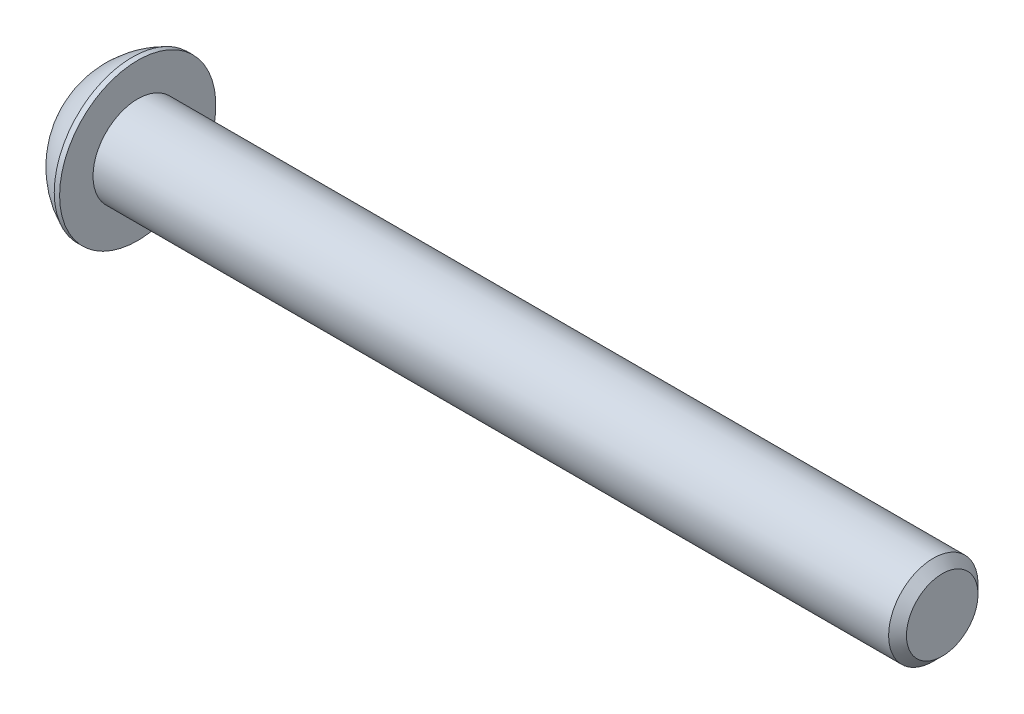
ISO-10303-21;
HEADER;
FILE_DESCRIPTION(('STEP AP214'),'2;1');
FILE_NAME('part.step','',(''),(''),'','','');
FILE_SCHEMA(('AUTOMOTIVE_DESIGN { 1 0 10303 214 1 1 1 1 }'));
ENDSEC;
DATA;
#1=APPLICATION_CONTEXT('core data for automotive mechanical design processes');
#2=APPLICATION_PROTOCOL_DEFINITION('international standard','automotive_design',2000,#1);
#3=PRODUCT_CONTEXT('',#1,'mechanical');
#4=PRODUCT('Part','Part','',(#3));
#5=PRODUCT_RELATED_PRODUCT_CATEGORY('part','',(#4));
#6=PRODUCT_DEFINITION_FORMATION('','',#4);
#7=PRODUCT_DEFINITION_CONTEXT('part definition',#1,'design');
#8=PRODUCT_DEFINITION('design','',#6,#7);
#9=PRODUCT_DEFINITION_SHAPE('','',#8);
#10=(LENGTH_UNIT() NAMED_UNIT(*) SI_UNIT(.MILLI.,.METRE.));
#11=(NAMED_UNIT(*) PLANE_ANGLE_UNIT() SI_UNIT($,.RADIAN.));
#12=(NAMED_UNIT(*) SI_UNIT($,.STERADIAN.) SOLID_ANGLE_UNIT());
#13=UNCERTAINTY_MEASURE_WITH_UNIT(LENGTH_MEASURE(1.E-05),#10,'distance_accuracy_value','');
#14=(GEOMETRIC_REPRESENTATION_CONTEXT(3) GLOBAL_UNCERTAINTY_ASSIGNED_CONTEXT((#13)) GLOBAL_UNIT_ASSIGNED_CONTEXT((#10,
#11,#12)) REPRESENTATION_CONTEXT('',''));
#15=CARTESIAN_POINT('',(0.,0.,0.));
#16=DIRECTION('',(0.,0.,1.));
#17=DIRECTION('',(1.,0.,0.));
#18=AXIS2_PLACEMENT_3D('',#15,#16,#17);
#19=CARTESIAN_POINT('',(1.32080000000034,0.,0.));
#20=DIRECTION('',(-1.,0.,0.));
#21=DIRECTION('',(0.,0.,1.));
#22=AXIS2_PLACEMENT_3D('',#19,#20,#21);
#23=CONICAL_SURFACE('',#22,1.1937999999998,1.04719755119608);
#24=CARTESIAN_POINT('',(2.01004075135902,0.,-4.44089209850063E-13));
#25=VERTEX_POINT('',#24);
#26=VERTEX_LOOP('',#25);
#27=FACE_BOUND('',#26,.T.);
#28=CARTESIAN_POINT('',(1.32080000000009,0.,0.));
#29=DIRECTION('',(-1.,0.,0.));
#30=DIRECTION('',(0.,0.,1.));
#31=AXIS2_PLACEMENT_3D('',#28,#29,#30);
#32=CIRCLE('',#31,1.19380000000024);
#33=CARTESIAN_POINT('',(1.32080000000009,0.,1.19380000000024));
#34=VERTEX_POINT('',#33);
#35=EDGE_CURVE('E19',#34,#34,#32,.T.);
#36=ORIENTED_EDGE('',*,*,#35,.T.);
#37=EDGE_LOOP('',(#36));
#38=FACE_BOUND('',#37,.T.);
#39=ADVANCED_FACE('F16',(#27,#38),#23,.F.);
#40=CARTESIAN_POINT('',(1.3208,-2.29135888084633,0.));
#41=DIRECTION('',(1.,0.,0.));
#42=DIRECTION('',(0.,0.,-1.));
#43=AXIS2_PLACEMENT_3D('',#40,#41,#42);
#44=PLANE('',#43);
#45=DIRECTION('',(0.,1.,0.));
#46=VECTOR('',#45,1.);
#47=CARTESIAN_POINT('',(1.3208,-1.14567944042316,1.984375));
#48=LINE('',#47,#46);
#49=CARTESIAN_POINT('',(1.3208,1.14567944042316,1.984375));
#50=VERTEX_POINT('',#49);
#51=CARTESIAN_POINT('',(1.3208,-1.14567944042316,1.984375));
#52=VERTEX_POINT('',#51);
#53=EDGE_CURVE('E68',#50,#52,#48,.F.);
#54=ORIENTED_EDGE('',*,*,#53,.F.);
#55=DIRECTION('',(0.,0.5,-0.866025403784439));
#56=VECTOR('',#55,1.);
#57=CARTESIAN_POINT('',(1.3208,1.14567944042316,1.984375));
#58=LINE('',#57,#56);
#59=CARTESIAN_POINT('',(1.3208,2.29135888084633,0.));
#60=VERTEX_POINT('',#59);
#61=EDGE_CURVE('E291',#60,#50,#58,.F.);
#62=ORIENTED_EDGE('',*,*,#61,.F.);
#63=DIRECTION('',(0.,-0.5,-0.866025403784439));
#64=VECTOR('',#63,1.);
#65=CARTESIAN_POINT('',(1.3208,2.29135888084633,0.));
#66=LINE('',#65,#64);
#67=CARTESIAN_POINT('',(1.3208,1.14567944042316,-1.984375));
#68=VERTEX_POINT('',#67);
#69=EDGE_CURVE('E295',#68,#60,#66,.F.);
#70=ORIENTED_EDGE('',*,*,#69,.F.);
#71=DIRECTION('',(0.,1.,0.));
#72=VECTOR('',#71,1.);
#73=CARTESIAN_POINT('',(1.3208,1.14567944042316,-1.984375));
#74=LINE('',#73,#72);
#75=CARTESIAN_POINT('',(1.3208,-1.14567944042316,-1.984375));
#76=VERTEX_POINT('',#75);
#77=EDGE_CURVE('E300',#76,#68,#74,.T.);
#78=ORIENTED_EDGE('',*,*,#77,.F.);
#79=DIRECTION('',(0.,-0.500000000000001,0.866025403784438));
#80=VECTOR('',#79,1.);
#81=CARTESIAN_POINT('',(1.3208,-1.14567944042316,-1.984375));
#82=LINE('',#81,#80);
#83=CARTESIAN_POINT('',(1.3208,-2.29135888084633,0.));
#84=VERTEX_POINT('',#83);
#85=EDGE_CURVE('E305',#84,#76,#82,.F.);
#86=ORIENTED_EDGE('',*,*,#85,.F.);
#87=DIRECTION('',(0.,0.500000000000001,0.866025403784438));
#88=VECTOR('',#87,1.);
#89=CARTESIAN_POINT('',(1.3208,-2.29135888084633,0.));
#90=LINE('',#89,#88);
#91=EDGE_CURVE('E81',#52,#84,#90,.F.);
#92=ORIENTED_EDGE('',*,*,#91,.F.);
#93=EDGE_LOOP('',(#54,#62,#70,#78,#86,#92));
#94=FACE_BOUND('',#93,.T.);
#95=ORIENTED_EDGE('',*,*,#35,.F.);
#96=EDGE_LOOP('',(#95));
#97=FACE_BOUND('',#96,.T.);
#98=ADVANCED_FACE('F74',(#94,#97),#44,.F.);
#99=CARTESIAN_POINT('',(1.3208,-1.14567944042316,1.984375));
#100=DIRECTION('',(0.,0.,-1.));
#101=DIRECTION('',(0.,1.,0.));
#102=AXIS2_PLACEMENT_3D('',#99,#100,#101);
#103=PLANE('',#102);
#104=ORIENTED_EDGE('',*,*,#53,.T.);
#105=DIRECTION('',(1.,0.,0.));
#106=VECTOR('',#105,1.);
#107=CARTESIAN_POINT('',(1.3208,-1.14567944042316,1.984375));
#108=LINE('',#107,#106);
#109=CARTESIAN_POINT('',(0.,-1.14567944042316,1.984375));
#110=VERTEX_POINT('',#109);
#111=EDGE_CURVE('E78',#110,#52,#108,.T.);
#112=ORIENTED_EDGE('',*,*,#111,.F.);
#113=DIRECTION('',(0.,1.,0.));
#114=VECTOR('',#113,1.);
#115=CARTESIAN_POINT('',(0.,0.,1.984375));
#116=LINE('',#115,#114);
#117=CARTESIAN_POINT('',(0.,1.14567944042316,1.984375));
#118=VERTEX_POINT('',#117);
#119=EDGE_CURVE('E285',#118,#110,#116,.F.);
#120=ORIENTED_EDGE('',*,*,#119,.F.);
#121=DIRECTION('',(1.,0.,0.));
#122=VECTOR('',#121,1.);
#123=CARTESIAN_POINT('',(1.3208,1.14567944042316,1.984375));
#124=LINE('',#123,#122);
#125=EDGE_CURVE('E288',#50,#118,#124,.F.);
#126=ORIENTED_EDGE('',*,*,#125,.F.);
#127=EDGE_LOOP('',(#104,#112,#120,#126));
#128=FACE_BOUND('',#127,.T.);
#129=ADVANCED_FACE('F127',(#128),#103,.T.);
#130=CARTESIAN_POINT('',(1.3208,-2.29135888084633,0.));
#131=DIRECTION('',(0.,0.866025403784438,-0.500000000000001));
#132=DIRECTION('',(0.,0.500000000000001,0.866025403784438));
#133=AXIS2_PLACEMENT_3D('',#130,#131,#132);
#134=PLANE('',#133);
#135=ORIENTED_EDGE('',*,*,#91,.T.);
#136=DIRECTION('',(1.,0.,0.));
#137=VECTOR('',#136,1.);
#138=CARTESIAN_POINT('',(1.3208,-2.29135888084633,0.));
#139=LINE('',#138,#137);
#140=CARTESIAN_POINT('',(0.,-2.29135888084633,0.));
#141=VERTEX_POINT('',#140);
#142=EDGE_CURVE('E307',#141,#84,#139,.T.);
#143=ORIENTED_EDGE('',*,*,#142,.F.);
#144=DIRECTION('',(0.,-0.500000000000001,-0.866025403784438));
#145=VECTOR('',#144,1.);
#146=CARTESIAN_POINT('',(0.,-1.14567944042316,1.984375));
#147=LINE('',#146,#145);
#148=EDGE_CURVE('E282',#110,#141,#147,.T.);
#149=ORIENTED_EDGE('',*,*,#148,.F.);
#150=ORIENTED_EDGE('',*,*,#111,.T.);
#151=EDGE_LOOP('',(#135,#143,#149,#150));
#152=FACE_BOUND('',#151,.T.);
#153=ADVANCED_FACE('F123',(#152),#134,.T.);
#154=CARTESIAN_POINT('',(1.3208,-1.14567944042316,-1.984375));
#155=DIRECTION('',(0.,0.866025403784438,0.500000000000001));
#156=DIRECTION('',(0.,-0.500000000000001,0.866025403784438));
#157=AXIS2_PLACEMENT_3D('',#154,#155,#156);
#158=PLANE('',#157);
#159=ORIENTED_EDGE('',*,*,#85,.T.);
#160=DIRECTION('',(1.,0.,0.));
#161=VECTOR('',#160,1.);
#162=CARTESIAN_POINT('',(1.3208,-1.14567944042316,-1.984375));
#163=LINE('',#162,#161);
#164=CARTESIAN_POINT('',(0.,-1.14567944042316,-1.984375));
#165=VERTEX_POINT('',#164);
#166=EDGE_CURVE('E302',#165,#76,#163,.T.);
#167=ORIENTED_EDGE('',*,*,#166,.F.);
#168=DIRECTION('',(0.,0.500000000000001,-0.866025403784438));
#169=VECTOR('',#168,1.);
#170=CARTESIAN_POINT('',(0.,-2.29135888084633,0.));
#171=LINE('',#170,#169);
#172=EDGE_CURVE('E279',#141,#165,#171,.T.);
#173=ORIENTED_EDGE('',*,*,#172,.F.);
#174=ORIENTED_EDGE('',*,*,#142,.T.);
#175=EDGE_LOOP('',(#159,#167,#173,#174));
#176=FACE_BOUND('',#175,.T.);
#177=ADVANCED_FACE('F119',(#176),#158,.T.);
#178=CARTESIAN_POINT('',(1.3208,1.14567944042316,-1.984375));
#179=DIRECTION('',(0.,0.,1.));
#180=DIRECTION('',(1.,0.,0.));
#181=AXIS2_PLACEMENT_3D('',#178,#179,#180);
#182=PLANE('',#181);
#183=ORIENTED_EDGE('',*,*,#77,.T.);
#184=DIRECTION('',(1.,0.,0.));
#185=VECTOR('',#184,1.);
#186=CARTESIAN_POINT('',(1.3208,1.14567944042316,-1.984375));
#187=LINE('',#186,#185);
#188=CARTESIAN_POINT('',(0.,1.14567944042316,-1.984375));
#189=VERTEX_POINT('',#188);
#190=EDGE_CURVE('E297',#189,#68,#187,.T.);
#191=ORIENTED_EDGE('',*,*,#190,.F.);
#192=DIRECTION('',(0.,1.,0.));
#193=VECTOR('',#192,1.);
#194=CARTESIAN_POINT('',(0.,0.,-1.984375));
#195=LINE('',#194,#193);
#196=EDGE_CURVE('E276',#165,#189,#195,.T.);
#197=ORIENTED_EDGE('',*,*,#196,.F.);
#198=ORIENTED_EDGE('',*,*,#166,.T.);
#199=EDGE_LOOP('',(#183,#191,#197,#198));
#200=FACE_BOUND('',#199,.T.);
#201=ADVANCED_FACE('F116',(#200),#182,.T.);
#202=CARTESIAN_POINT('',(1.3208,2.29135888084633,0.));
#203=DIRECTION('',(0.,-0.866025403784439,0.5));
#204=DIRECTION('',(0.,-0.5,-0.866025403784439));
#205=AXIS2_PLACEMENT_3D('',#202,#203,#204);
#206=PLANE('',#205);
#207=ORIENTED_EDGE('',*,*,#69,.T.);
#208=DIRECTION('',(1.,0.,0.));
#209=VECTOR('',#208,1.);
#210=CARTESIAN_POINT('',(1.3208,2.29135888084633,0.));
#211=LINE('',#210,#209);
#212=CARTESIAN_POINT('',(0.,2.29135888084633,0.));
#213=VERTEX_POINT('',#212);
#214=EDGE_CURVE('E34',#213,#60,#211,.T.);
#215=ORIENTED_EDGE('',*,*,#214,.F.);
#216=DIRECTION('',(0.,0.5,0.866025403784439));
#217=VECTOR('',#216,1.);
#218=CARTESIAN_POINT('',(0.,1.14567944042316,-1.984375));
#219=LINE('',#218,#217);
#220=EDGE_CURVE('E273',#189,#213,#219,.T.);
#221=ORIENTED_EDGE('',*,*,#220,.F.);
#222=ORIENTED_EDGE('',*,*,#190,.T.);
#223=EDGE_LOOP('',(#207,#215,#221,#222));
#224=FACE_BOUND('',#223,.T.);
#225=ADVANCED_FACE('F112',(#224),#206,.T.);
#226=CARTESIAN_POINT('',(1.3208,1.14567944042316,1.984375));
#227=DIRECTION('',(0.,-0.866025403784439,-0.5));
#228=DIRECTION('',(0.,0.5,-0.866025403784439));
#229=AXIS2_PLACEMENT_3D('',#226,#227,#228);
#230=PLANE('',#229);
#231=ORIENTED_EDGE('',*,*,#61,.T.);
#232=ORIENTED_EDGE('',*,*,#125,.T.);
#233=DIRECTION('',(0.,-0.5,0.866025403784438));
#234=VECTOR('',#233,1.);
#235=CARTESIAN_POINT('',(0.,2.29135888084633,0.));
#236=LINE('',#235,#234);
#237=EDGE_CURVE('E99',#213,#118,#236,.T.);
#238=ORIENTED_EDGE('',*,*,#237,.F.);
#239=ORIENTED_EDGE('',*,*,#214,.T.);
#240=EDGE_LOOP('',(#231,#232,#238,#239));
#241=FACE_BOUND('',#240,.T.);
#242=ADVANCED_FACE('F108',(#241),#230,.T.);
#243=CARTESIAN_POINT('',(0.,0.,0.));
#244=DIRECTION('',(-1.,0.,0.));
#245=DIRECTION('',(0.,0.,1.));
#246=AXIS2_PLACEMENT_3D('',#243,#244,#245);
#247=PLANE('',#246);
#248=ORIENTED_EDGE('',*,*,#220,.T.);
#249=ORIENTED_EDGE('',*,*,#237,.T.);
#250=ORIENTED_EDGE('',*,*,#119,.T.);
#251=ORIENTED_EDGE('',*,*,#148,.T.);
#252=ORIENTED_EDGE('',*,*,#172,.T.);
#253=ORIENTED_EDGE('',*,*,#196,.T.);
#254=EDGE_LOOP('',(#248,#249,#250,#251,#252,#253));
#255=FACE_BOUND('',#254,.T.);
#256=CARTESIAN_POINT('',(0.,2.77495,0.));
#257=CARTESIAN_POINT('',(0.,2.77494953309947,0.0779118937523459));
#258=CARTESIAN_POINT('',(0.,2.77166578388025,0.15583810591977));
#259=CARTESIAN_POINT('',(0.,2.75855213600204,0.311152012455904));
#260=CARTESIAN_POINT('',(0.,2.74872030471467,0.388539541019556));
#261=CARTESIAN_POINT('',(0.,2.72255472645676,0.542341518735717));
#262=CARTESIAN_POINT('',(-2.70414110576258E-13,2.70621065843663,0.618754223567578));
#263=CARTESIAN_POINT('',(2.71501725221868E-13,2.66713326915777,0.769973634286023));
#264=CARTESIAN_POINT('',(1.01274952524446E-12,2.64439476297869,0.844778983646282));
#265=CARTESIAN_POINT('',(1.81909959813207E-12,2.56690195943351,1.06566239301792));
#266=CARTESIAN_POINT('',(4.77081687541822E-13,2.50280672569928,1.20857954243987));
#267=CARTESIAN_POINT('',(-4.76232447128612E-13,2.35149826934097,1.48160874561538));
#268=CARTESIAN_POINT('',(0.,2.26428416790397,1.61172031233499));
#269=CARTESIAN_POINT('',(0.,2.1181093928834,1.79445660654268));
#270=CARTESIAN_POINT('',(0.,2.06678693791626,1.85333128513996));
#271=CARTESIAN_POINT('',(0.,1.95940522984449,1.96650727912792));
#272=CARTESIAN_POINT('',(0.,1.90335059143535,2.02081294920044));
#273=CARTESIAN_POINT('',(0.,1.78683891013963,2.12453280878582));
#274=CARTESIAN_POINT('',(0.,1.72637988450322,2.1739447713554));
#275=CARTESIAN_POINT('',(0.,1.60151968865711,2.26750481692908));
#276=CARTESIAN_POINT('',(0.,1.53711760864537,2.31165167810847));
#277=CARTESIAN_POINT('',(0.,1.33869902291632,2.43567242603944));
#278=CARTESIAN_POINT('',(0.,1.19934704110695,2.507235886628));
#279=CARTESIAN_POINT('',(0.,0.910681609121881,2.62590828672821));
#280=CARTESIAN_POINT('',(0.,0.761368265357398,2.67301748742278));
#281=CARTESIAN_POINT('',(0.,0.456932649466623,2.74151230664007));
#282=CARTESIAN_POINT('',(0.,0.301810346322584,2.76289778778721));
#283=CARTESIAN_POINT('',(0.,-0.00982263870895171,2.77931595661156));
#284=CARTESIAN_POINT('',(0.,-0.166333320596448,2.77434864428877));
#285=CARTESIAN_POINT('',(0.,-0.476280836814452,2.73822217653073));
#286=CARTESIAN_POINT('',(0.,-0.629717687555985,2.70706316096981));
#287=CARTESIAN_POINT('',(0.,-0.929254830044274,2.61937980771149));
#288=CARTESIAN_POINT('',(0.,-1.0753550434132,2.56285519909568));
#289=CARTESIAN_POINT('',(0.,-1.28570692598579,2.46037024128109));
#290=CARTESIAN_POINT('',(0.,-1.35439130022287,2.42323494812896));
#291=CARTESIAN_POINT('',(0.,-1.488391287199,2.34331277270256));
#292=CARTESIAN_POINT('',(0.,-1.55370767631787,2.30052720108831));
#293=CARTESIAN_POINT('',(0.,-1.68047292776594,2.20962421887055));
#294=CARTESIAN_POINT('',(0.,-1.7419235278682,2.16150923122348));
#295=CARTESIAN_POINT('',(0.,-1.86060297067992,2.06024311301283));
#296=CARTESIAN_POINT('',(0.,-1.91782768181715,2.0070871669763));
#297=CARTESIAN_POINT('',(0.,-2.08239462196651,1.8407220856554));
#298=CARTESIAN_POINT('',(0.,-2.18279764272601,1.72049499758422));
#299=CARTESIAN_POINT('',(0.,-2.36195754944063,1.46487629213018));
#300=CARTESIAN_POINT('',(0.,-2.44071525816758,1.32948525142807));
#301=CARTESIAN_POINT('',(0.,-2.54098882695274,1.11796734074395));
#302=CARTESIAN_POINT('',(0.,-2.57146177392727,1.04596540008347));
#303=CARTESIAN_POINT('',(0.,-2.62621251108999,0.899689259475764));
#304=CARTESIAN_POINT('',(0.,-2.65049531495563,0.825416953360952));
#305=CARTESIAN_POINT('',(0.,-2.69267708798766,0.675215808695207));
#306=CARTESIAN_POINT('',(0.,-2.71058613777937,0.599289789313092));
#307=CARTESIAN_POINT('',(0.,-2.73994710360127,0.446213628496932));
#308=CARTESIAN_POINT('',(0.,-2.75140092413871,0.369063855024788));
#309=CARTESIAN_POINT('',(0.,-2.76470470685522,0.24316208817343));
#310=CARTESIAN_POINT('',(0.,-2.76854547596618,0.194611672428577));
#311=CARTESIAN_POINT('',(0.,-2.77366826843264,0.0973760351839812));
#312=CARTESIAN_POINT('',(0.,-2.77495029178814,0.0486908136842395));
#313=CARTESIAN_POINT('',(0.,-2.77494953309947,-0.0779118937523475));
#314=CARTESIAN_POINT('',(0.,-2.77166578388025,-0.155838105919772));
#315=CARTESIAN_POINT('',(0.,-2.75855213600204,-0.311152012455906));
#316=CARTESIAN_POINT('',(0.,-2.74872030471467,-0.388539541019558));
#317=CARTESIAN_POINT('',(0.,-2.72255472645677,-0.542341518735719));
#318=CARTESIAN_POINT('',(-2.70149297926331E-13,-2.70621065843663,-0.61875422356758));
#319=CARTESIAN_POINT('',(2.712366972268E-13,-2.66713326915777,-0.769973634286024));
#320=CARTESIAN_POINT('',(1.0114146773846E-12,-2.64439476297869,-0.844778983646283));
#321=CARTESIAN_POINT('',(1.81656702958366E-12,-2.5669019594335,-1.06566239301792));
#322=CARTESIAN_POINT('',(4.7641829195856E-13,-2.50280672569928,-1.20857954243988));
#323=CARTESIAN_POINT('',(-4.75569026324205E-13,-2.35149826934097,-1.48160874561538));
#324=CARTESIAN_POINT('',(0.,-2.26428416790396,-1.61172031233499));
#325=CARTESIAN_POINT('',(0.,-2.1181093928834,-1.79445660654268));
#326=CARTESIAN_POINT('',(0.,-2.06678693791626,-1.85333128513997));
#327=CARTESIAN_POINT('',(0.,-1.95940522984449,-1.96650727912792));
#328=CARTESIAN_POINT('',(0.,-1.90335059143535,-2.02081294920044));
#329=CARTESIAN_POINT('',(0.,-1.78683891013963,-2.12453280878582));
#330=CARTESIAN_POINT('',(0.,-1.72637988450322,-2.1739447713554));
#331=CARTESIAN_POINT('',(0.,-1.60151968865711,-2.26750481692908));
#332=CARTESIAN_POINT('',(0.,-1.53711760864537,-2.31165167810847));
#333=CARTESIAN_POINT('',(0.,-1.33869902291632,-2.43567242603944));
#334=CARTESIAN_POINT('',(0.,-1.19934704110695,-2.507235886628));
#335=CARTESIAN_POINT('',(0.,-0.91068160912188,-2.62590828672821));
#336=CARTESIAN_POINT('',(0.,-0.761368265357396,-2.67301748742278));
#337=CARTESIAN_POINT('',(0.,-0.456932649466621,-2.74151230664007));
#338=CARTESIAN_POINT('',(0.,-0.301810346322582,-2.76289778778721));
#339=CARTESIAN_POINT('',(0.,0.00982263870895353,-2.77931595661156));
#340=CARTESIAN_POINT('',(0.,0.16633332059645,-2.77434864428876));
#341=CARTESIAN_POINT('',(0.,0.476280836814454,-2.73822217653073));
#342=CARTESIAN_POINT('',(0.,0.629717687555987,-2.70706316096981));
#343=CARTESIAN_POINT('',(0.,0.929254830044276,-2.6193798077115));
#344=CARTESIAN_POINT('',(0.,1.0753550434132,-2.56285519909568));
#345=CARTESIAN_POINT('',(0.,1.28570692598579,-2.46037024128109));
#346=CARTESIAN_POINT('',(0.,1.35439130022287,-2.42323494812896));
#347=CARTESIAN_POINT('',(0.,1.488391287199,-2.34331277270256));
#348=CARTESIAN_POINT('',(0.,1.55370767631787,-2.30052720108831));
#349=CARTESIAN_POINT('',(0.,1.68047292776594,-2.20962421887055));
#350=CARTESIAN_POINT('',(0.,1.7419235278682,-2.16150923122348));
#351=CARTESIAN_POINT('',(0.,1.86060297067992,-2.06024311301282));
#352=CARTESIAN_POINT('',(0.,1.91782768181716,-2.0070871669763));
#353=CARTESIAN_POINT('',(0.,2.08239462196651,-1.8407220856554));
#354=CARTESIAN_POINT('',(0.,2.18279764272601,-1.72049499758422));
#355=CARTESIAN_POINT('',(0.,2.36195754944063,-1.46487629213018));
#356=CARTESIAN_POINT('',(0.,2.44071525816757,-1.32948525142807));
#357=CARTESIAN_POINT('',(0.,2.54098882695273,-1.11796734074395));
#358=CARTESIAN_POINT('',(0.,2.57146177392727,-1.04596540008347));
#359=CARTESIAN_POINT('',(0.,2.62621251108999,-0.899689259475765));
#360=CARTESIAN_POINT('',(0.,2.65049531495563,-0.825416953360953));
#361=CARTESIAN_POINT('',(0.,2.69267708798766,-0.675215808695207));
#362=CARTESIAN_POINT('',(0.,2.71058613777936,-0.599289789313092));
#363=CARTESIAN_POINT('',(0.,2.73994710360127,-0.446213628496932));
#364=CARTESIAN_POINT('',(0.,2.75140092413871,-0.369063855024789));
#365=CARTESIAN_POINT('',(0.,2.76470470685522,-0.243162088173432));
#366=CARTESIAN_POINT('',(0.,2.76854547596618,-0.194611672428578));
#367=CARTESIAN_POINT('',(0.,2.77366826843264,-0.0973760351839823));
#368=CARTESIAN_POINT('',(0.,2.77495029178814,-0.0486908136842408));
#369=CARTESIAN_POINT('',(0.,2.77495,0.));
#370=B_SPLINE_CURVE_WITH_KNOTS('',3,(#256,#257,#258,#259,#260,#261,#262,#263,#264,#265,#266,
#267,#268,#269,#270,#271,#272,#273,#274,#275,#276,#277,#278,#279,#280,#281,#282,#283,#284,#285,
#286,#287,#288,#289,#290,#291,#292,#293,#294,#295,#296,#297,#298,#299,#300,#301,#302,#303,#304,
#305,#306,#307,#308,#309,#310,#311,#312,#313,#314,#315,#316,#317,#318,#319,#320,#321,#322,#323,
#324,#325,#326,#327,#328,#329,#330,#331,#332,#333,#334,#335,#336,#337,#338,#339,#340,#341,#342,
#343,#344,#345,#346,#347,#348,#349,#350,#351,#352,#353,#354,#355,#356,#357,#358,#359,#360,#361,
#362,#363,#364,#365,#366,#367,#368,#369),.UNSPECIFIED.,.T.,.F.,(4,2,2,2,2,2,2,2,2,2,2,2,2,2,2,2,
2,2,2,2,2,2,2,2,2,2,2,2,2,2,2,2,2,2,2,2,2,2,2,2,2,2,2,2,2,2,2,2,2,2,2,2,2,2,2,2,4),(0.,
0.233690856748162,0.467450716578751,0.701582538521471,0.935904756015414,1.40343220467667,
1.87097742791502,2.10505636898837,2.33890962270652,2.57286880998746,2.80688218486306,
3.27442101763127,3.74195485676357,4.20949119271389,4.67702752866417,5.14456136779641,
5.61210020056468,5.84611357544033,6.08007276272136,6.31392601643949,6.54800495751273,
7.01555018075072,7.48307762941212,7.71739984690652,7.95153166884955,8.18529152868023,
8.41898238542855,8.56502681353347,8.71107124163843,8.94476209838659,9.17852195821718,
9.4126537801599,9.64697599765384,10.1145034463151,10.5820486695534,10.8161276106268,
11.0499808643449,11.2839400516259,11.5179534265015,11.9854922592697,12.453026098402,
12.9205624343523,13.3880987703026,13.8556326094348,14.3231714422031,14.5571848170788,
14.7911440043598,15.0249972580779,15.2590761991512,15.7266214223891,16.1941488710506,
16.4284710885449,16.662602910488,16.8963627703186,17.130053627067,17.2760980551719,
17.4221424832769),.UNSPECIFIED.);
#371=CARTESIAN_POINT('',(0.,2.77495,0.));
#372=VERTEX_POINT('',#371);
#373=EDGE_CURVE('E93',#372,#372,#370,.T.);
#374=ORIENTED_EDGE('',*,*,#373,.F.);
#375=EDGE_LOOP('',(#374));
#376=FACE_BOUND('',#375,.T.);
#377=ADVANCED_FACE('F104',(#255,#376),#247,.T.);
#378=CARTESIAN_POINT('',(5.37260881410256,0.,0.));
#379=DIRECTION('',(0.,1.,0.));
#380=DIRECTION('',(1.,0.,0.));
#381=AXIS2_PLACEMENT_3D('',#378,#379,#380);
#382=SPHERICAL_SURFACE('',#381,6.04692260342999);
#383=CARTESIAN_POINT('',(2.9718,0.,0.));
#384=DIRECTION('',(-1.,0.,0.));
#385=DIRECTION('',(0.,0.,1.));
#386=AXIS2_PLACEMENT_3D('',#383,#384,#385);
#387=CIRCLE('',#386,5.5499);
#388=CARTESIAN_POINT('',(2.9718,0.,5.5499));
#389=VERTEX_POINT('',#388);
#390=EDGE_CURVE('E91',#389,#389,#387,.F.);
#391=ORIENTED_EDGE('',*,*,#390,.F.);
#392=EDGE_LOOP('',(#391));
#393=FACE_BOUND('',#392,.T.);
#394=ORIENTED_EDGE('',*,*,#373,.T.);
#395=EDGE_LOOP('',(#394));
#396=FACE_BOUND('',#395,.T.);
#397=ADVANCED_FACE('F100',(#393,#396),#382,.T.);
#398=CARTESIAN_POINT('',(60.5028,0.,0.));
#399=DIRECTION('',(-1.,0.,0.));
#400=DIRECTION('',(0.,0.,1.));
#401=AXIS2_PLACEMENT_3D('',#398,#399,#400);
#402=PLANE('',#401);
#403=CARTESIAN_POINT('',(60.5027999999947,0.,0.));
#404=DIRECTION('',(-1.,0.,0.));
#405=DIRECTION('',(0.,0.,1.));
#406=AXIS2_PLACEMENT_3D('',#403,#404,#405);
#407=CIRCLE('',#406,2.54000000001042);
#408=CARTESIAN_POINT('',(60.5027999999947,0.,2.54000000001042));
#409=VERTEX_POINT('',#408);
#410=EDGE_CURVE('E88',#409,#409,#407,.T.);
#411=ORIENTED_EDGE('',*,*,#410,.F.);
#412=EDGE_LOOP('',(#411));
#413=FACE_BOUND('',#412,.T.);
#414=ADVANCED_FACE('F154',(#413),#402,.F.);
#415=CARTESIAN_POINT('',(0.,0.,0.));
#416=DIRECTION('',(-1.,0.,0.));
#417=DIRECTION('',(0.,0.,1.));
#418=AXIS2_PLACEMENT_3D('',#415,#416,#417);
#419=CYLINDRICAL_SURFACE('',#418,5.5499);
#420=ORIENTED_EDGE('',*,*,#390,.T.);
#421=EDGE_LOOP('',(#420));
#422=FACE_BOUND('',#421,.T.);
#423=CARTESIAN_POINT('',(3.3528,0.,0.));
#424=DIRECTION('',(-1.,0.,0.));
#425=DIRECTION('',(0.,0.,1.));
#426=AXIS2_PLACEMENT_3D('',#423,#424,#425);
#427=CIRCLE('',#426,5.5499);
#428=CARTESIAN_POINT('',(3.3528,0.,5.5499));
#429=VERTEX_POINT('',#428);
#430=EDGE_CURVE('E85',#429,#429,#427,.T.);
#431=ORIENTED_EDGE('',*,*,#430,.T.);
#432=EDGE_LOOP('',(#431));
#433=FACE_BOUND('',#432,.T.);
#434=ADVANCED_FACE('F151',(#422,#433),#419,.T.);
#435=CARTESIAN_POINT('',(59.8678000000064,0.,0.));
#436=DIRECTION('',(-1.,0.,0.));
#437=DIRECTION('',(0.,0.,1.));
#438=AXIS2_PLACEMENT_3D('',#435,#436,#437);
#439=CONICAL_SURFACE('',#438,3.17499999999882,0.785398163397448);
#440=CARTESIAN_POINT('',(59.8678,0.,0.));
#441=DIRECTION('',(-1.,0.,0.));
#442=DIRECTION('',(0.,0.,1.));
#443=AXIS2_PLACEMENT_3D('',#440,#441,#442);
#444=CIRCLE('',#443,3.175);
#445=CARTESIAN_POINT('',(59.8678,0.,3.175));
#446=VERTEX_POINT('',#445);
#447=EDGE_CURVE('E25',#446,#446,#444,.T.);
#448=ORIENTED_EDGE('',*,*,#447,.F.);
#449=EDGE_LOOP('',(#448));
#450=FACE_BOUND('',#449,.T.);
#451=ORIENTED_EDGE('',*,*,#410,.T.);
#452=EDGE_LOOP('',(#451));
#453=FACE_BOUND('',#452,.T.);
#454=ADVANCED_FACE('F144',(#450,#453),#439,.T.);
#455=CARTESIAN_POINT('',(3.3528,3.175,0.));
#456=DIRECTION('',(-1.,0.,0.));
#457=DIRECTION('',(0.,0.,1.));
#458=AXIS2_PLACEMENT_3D('',#455,#456,#457);
#459=PLANE('',#458);
#460=CARTESIAN_POINT('',(3.3528,0.,0.));
#461=DIRECTION('',(-1.,0.,0.));
#462=DIRECTION('',(0.,0.,1.));
#463=AXIS2_PLACEMENT_3D('',#460,#461,#462);
#464=CIRCLE('',#463,3.175);
#465=CARTESIAN_POINT('',(3.3528,0.,3.175));
#466=VERTEX_POINT('',#465);
#467=EDGE_CURVE('E11',#466,#466,#464,.F.);
#468=ORIENTED_EDGE('',*,*,#467,.F.);
#469=EDGE_LOOP('',(#468));
#470=FACE_BOUND('',#469,.T.);
#471=ORIENTED_EDGE('',*,*,#430,.F.);
#472=EDGE_LOOP('',(#471));
#473=FACE_BOUND('',#472,.T.);
#474=ADVANCED_FACE('F138',(#470,#473),#459,.F.);
#475=CARTESIAN_POINT('',(0.,0.,0.));
#476=DIRECTION('',(-1.,0.,0.));
#477=DIRECTION('',(0.,0.,1.));
#478=AXIS2_PLACEMENT_3D('',#475,#476,#477);
#479=CYLINDRICAL_SURFACE('',#478,3.175);
#480=ORIENTED_EDGE('',*,*,#467,.T.);
#481=EDGE_LOOP('',(#480));
#482=FACE_BOUND('',#481,.T.);
#483=ORIENTED_EDGE('',*,*,#447,.T.);
#484=EDGE_LOOP('',(#483));
#485=FACE_BOUND('',#484,.T.);
#486=ADVANCED_FACE('F136',(#482,#485),#479,.T.);
#487=CLOSED_SHELL('',(#39,#98,#129,#153,#177,#201,#225,#242,#377,#397,#414,#434,#454,#474,#486));
#488=MANIFOLD_SOLID_BREP('B1',#487);
#489=ADVANCED_BREP_SHAPE_REPRESENTATION('',(#18,#488),#14);
#490=SHAPE_DEFINITION_REPRESENTATION(#9,#489);
ENDSEC;
END-ISO-10303-21;
